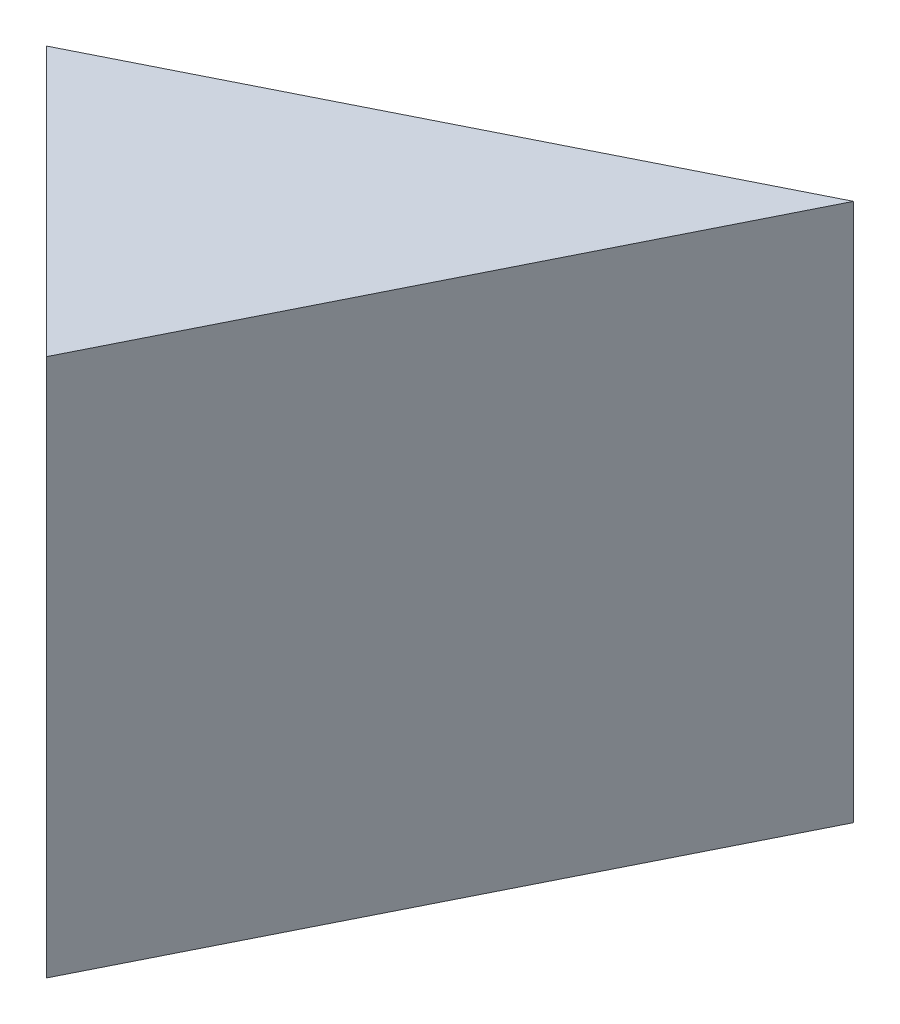
ISO-10303-21;
HEADER;
FILE_DESCRIPTION(('STEP AP214'),'2;1');
FILE_NAME('part.step','',(''),(''),'','','');
FILE_SCHEMA(('AUTOMOTIVE_DESIGN { 1 0 10303 214 1 1 1 1 }'));
ENDSEC;
DATA;
#1=APPLICATION_CONTEXT('core data for automotive mechanical design processes');
#2=APPLICATION_PROTOCOL_DEFINITION('international standard','automotive_design',2000,#1);
#3=PRODUCT_CONTEXT('',#1,'mechanical');
#4=PRODUCT('Part','Part','',(#3));
#5=PRODUCT_RELATED_PRODUCT_CATEGORY('part','',(#4));
#6=PRODUCT_DEFINITION_FORMATION('','',#4);
#7=PRODUCT_DEFINITION_CONTEXT('part definition',#1,'design');
#8=PRODUCT_DEFINITION('design','',#6,#7);
#9=PRODUCT_DEFINITION_SHAPE('','',#8);
#10=(LENGTH_UNIT() NAMED_UNIT(*) SI_UNIT(.MILLI.,.METRE.));
#11=(NAMED_UNIT(*) PLANE_ANGLE_UNIT() SI_UNIT($,.RADIAN.));
#12=(NAMED_UNIT(*) SI_UNIT($,.STERADIAN.) SOLID_ANGLE_UNIT());
#13=UNCERTAINTY_MEASURE_WITH_UNIT(LENGTH_MEASURE(1.E-05),#10,'distance_accuracy_value','');
#14=(GEOMETRIC_REPRESENTATION_CONTEXT(3) GLOBAL_UNCERTAINTY_ASSIGNED_CONTEXT((#13)) GLOBAL_UNIT_ASSIGNED_CONTEXT((#10,
#11,#12)) REPRESENTATION_CONTEXT('',''));
#15=CARTESIAN_POINT('',(0.,0.,0.));
#16=DIRECTION('',(0.,0.,1.));
#17=DIRECTION('',(1.,0.,0.));
#18=AXIS2_PLACEMENT_3D('',#15,#16,#17);
#19=CARTESIAN_POINT('',(0.,0.,20.));
#20=DIRECTION('',(0.,1.,0.));
#21=DIRECTION('',(0.,0.,1.));
#22=AXIS2_PLACEMENT_3D('',#19,#20,#21);
#23=PLANE('',#22);
#24=DIRECTION('',(-0.707106781186548,0.,-0.707106781186548));
#25=VECTOR('',#24,1.);
#26=CARTESIAN_POINT('',(10.,0.,20.));
#27=LINE('',#26,#25);
#28=CARTESIAN_POINT('',(10.,0.,20.));
#29=VERTEX_POINT('',#28);
#30=CARTESIAN_POINT('',(0.,0.,10.));
#31=VERTEX_POINT('',#30);
#32=EDGE_CURVE('E47',#29,#31,#27,.T.);
#33=ORIENTED_EDGE('',*,*,#32,.T.);
#34=DIRECTION('',(0.894427190999916,0.,-0.447213595499958));
#35=VECTOR('',#34,1.);
#36=CARTESIAN_POINT('',(20.,0.,0.));
#37=LINE('',#36,#35);
#38=CARTESIAN_POINT('',(20.,0.,0.));
#39=VERTEX_POINT('',#38);
#40=EDGE_CURVE('E56',#31,#39,#37,.T.);
#41=ORIENTED_EDGE('',*,*,#40,.T.);
#42=DIRECTION('',(-0.447213595499958,0.,0.894427190999916));
#43=VECTOR('',#42,1.);
#44=CARTESIAN_POINT('',(20.,0.,0.));
#45=LINE('',#44,#43);
#46=EDGE_CURVE('E73',#39,#29,#45,.T.);
#47=ORIENTED_EDGE('',*,*,#46,.T.);
#48=EDGE_LOOP('',(#33,#41,#47));
#49=FACE_BOUND('',#48,.T.);
#50=ADVANCED_FACE('F33',(#49),#23,.F.);
#51=CARTESIAN_POINT('',(0.,20.,20.));
#52=DIRECTION('',(0.,-1.,0.));
#53=DIRECTION('',(0.,0.,-1.));
#54=AXIS2_PLACEMENT_3D('',#51,#52,#53);
#55=PLANE('',#54);
#56=DIRECTION('',(-0.447213595499958,0.,0.894427190999916));
#57=VECTOR('',#56,1.);
#58=CARTESIAN_POINT('',(20.,20.,0.));
#59=LINE('',#58,#57);
#60=CARTESIAN_POINT('',(20.,20.,0.));
#61=VERTEX_POINT('',#60);
#62=CARTESIAN_POINT('',(10.,20.,20.));
#63=VERTEX_POINT('',#62);
#64=EDGE_CURVE('E77',#61,#63,#59,.T.);
#65=ORIENTED_EDGE('',*,*,#64,.F.);
#66=DIRECTION('',(0.894427190999916,0.,-0.447213595499958));
#67=VECTOR('',#66,1.);
#68=CARTESIAN_POINT('',(20.,20.,0.));
#69=LINE('',#68,#67);
#70=CARTESIAN_POINT('',(0.,20.,10.));
#71=VERTEX_POINT('',#70);
#72=EDGE_CURVE('E66',#71,#61,#69,.T.);
#73=ORIENTED_EDGE('',*,*,#72,.F.);
#74=DIRECTION('',(-0.707106781186548,0.,-0.707106781186548));
#75=VECTOR('',#74,1.);
#76=CARTESIAN_POINT('',(10.,20.,20.));
#77=LINE('',#76,#75);
#78=EDGE_CURVE('E74',#63,#71,#77,.T.);
#79=ORIENTED_EDGE('',*,*,#78,.F.);
#80=EDGE_LOOP('',(#65,#73,#79));
#81=FACE_BOUND('',#80,.T.);
#82=ADVANCED_FACE('F89',(#81),#55,.F.);
#83=CARTESIAN_POINT('',(20.,0.,0.));
#84=DIRECTION('',(-0.894427190999916,0.,-0.447213595499958));
#85=DIRECTION('',(-0.447213595499958,0.,0.894427190999916));
#86=AXIS2_PLACEMENT_3D('',#83,#84,#85);
#87=PLANE('',#86);
#88=ORIENTED_EDGE('',*,*,#64,.T.);
#89=DIRECTION('',(0.,1.,0.));
#90=VECTOR('',#89,1.);
#91=CARTESIAN_POINT('',(10.,0.,20.));
#92=LINE('',#91,#90);
#93=EDGE_CURVE('E40',#29,#63,#92,.T.);
#94=ORIENTED_EDGE('',*,*,#93,.F.);
#95=ORIENTED_EDGE('',*,*,#46,.F.);
#96=DIRECTION('',(0.,1.,0.));
#97=VECTOR('',#96,1.);
#98=CARTESIAN_POINT('',(20.,0.,0.));
#99=LINE('',#98,#97);
#100=EDGE_CURVE('E11',#39,#61,#99,.T.);
#101=ORIENTED_EDGE('',*,*,#100,.T.);
#102=EDGE_LOOP('',(#88,#94,#95,#101));
#103=FACE_BOUND('',#102,.T.);
#104=ADVANCED_FACE('F76',(#103),#87,.F.);
#105=CARTESIAN_POINT('',(10.,0.,20.));
#106=DIRECTION('',(0.707106781186548,0.,-0.707106781186548));
#107=DIRECTION('',(-0.707106781186548,0.,-0.707106781186548));
#108=AXIS2_PLACEMENT_3D('',#105,#106,#107);
#109=PLANE('',#108);
#110=ORIENTED_EDGE('',*,*,#78,.T.);
#111=DIRECTION('',(0.,1.,0.));
#112=VECTOR('',#111,1.);
#113=CARTESIAN_POINT('',(0.,0.,10.));
#114=LINE('',#113,#112);
#115=EDGE_CURVE('E79',#31,#71,#114,.T.);
#116=ORIENTED_EDGE('',*,*,#115,.F.);
#117=ORIENTED_EDGE('',*,*,#32,.F.);
#118=ORIENTED_EDGE('',*,*,#93,.T.);
#119=EDGE_LOOP('',(#110,#116,#117,#118));
#120=FACE_BOUND('',#119,.T.);
#121=ADVANCED_FACE('F87',(#120),#109,.F.);
#122=CARTESIAN_POINT('',(20.,0.,0.));
#123=DIRECTION('',(0.447213595499958,0.,0.894427190999916));
#124=DIRECTION('',(0.894427190999916,0.,-0.447213595499958));
#125=AXIS2_PLACEMENT_3D('',#122,#123,#124);
#126=PLANE('',#125);
#127=ORIENTED_EDGE('',*,*,#72,.T.);
#128=ORIENTED_EDGE('',*,*,#100,.F.);
#129=ORIENTED_EDGE('',*,*,#40,.F.);
#130=ORIENTED_EDGE('',*,*,#115,.T.);
#131=EDGE_LOOP('',(#127,#128,#129,#130));
#132=FACE_BOUND('',#131,.T.);
#133=ADVANCED_FACE('F64',(#132),#126,.F.);
#134=CLOSED_SHELL('',(#50,#82,#104,#121,#133));
#135=MANIFOLD_SOLID_BREP('B2',#134);
#136=ADVANCED_BREP_SHAPE_REPRESENTATION('',(#18,#135),#14);
#137=SHAPE_DEFINITION_REPRESENTATION(#9,#136);
ENDSEC;
END-ISO-10303-21;
